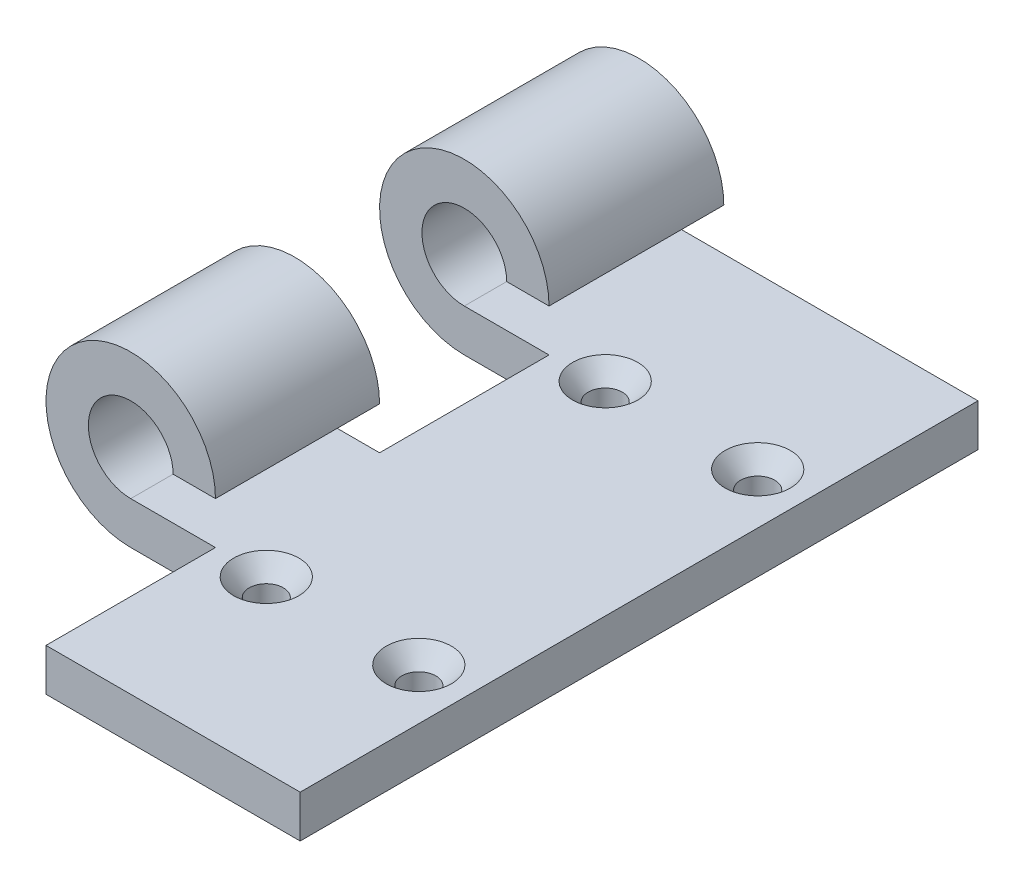
ISO-10303-21;
HEADER;
FILE_DESCRIPTION(('STEP AP214'),'2;1');
FILE_NAME('part.step','',(''),(''),'','','');
FILE_SCHEMA(('AUTOMOTIVE_DESIGN { 1 0 10303 214 1 1 1 1 }'));
ENDSEC;
DATA;
#1=APPLICATION_CONTEXT('core data for automotive mechanical design processes');
#2=APPLICATION_PROTOCOL_DEFINITION('international standard','automotive_design',2000,#1);
#3=PRODUCT_CONTEXT('',#1,'mechanical');
#4=PRODUCT('Part','Part','',(#3));
#5=PRODUCT_RELATED_PRODUCT_CATEGORY('part','',(#4));
#6=PRODUCT_DEFINITION_FORMATION('','',#4);
#7=PRODUCT_DEFINITION_CONTEXT('part definition',#1,'design');
#8=PRODUCT_DEFINITION('design','',#6,#7);
#9=PRODUCT_DEFINITION_SHAPE('','',#8);
#10=(LENGTH_UNIT() NAMED_UNIT(*) SI_UNIT(.MILLI.,.METRE.));
#11=(NAMED_UNIT(*) PLANE_ANGLE_UNIT() SI_UNIT($,.RADIAN.));
#12=(NAMED_UNIT(*) SI_UNIT($,.STERADIAN.) SOLID_ANGLE_UNIT());
#13=UNCERTAINTY_MEASURE_WITH_UNIT(LENGTH_MEASURE(1.E-05),#10,'distance_accuracy_value','');
#14=(GEOMETRIC_REPRESENTATION_CONTEXT(3) GLOBAL_UNCERTAINTY_ASSIGNED_CONTEXT((#13)) GLOBAL_UNIT_ASSIGNED_CONTEXT((#10,
#11,#12)) REPRESENTATION_CONTEXT('',''));
#15=CARTESIAN_POINT('',(0.,0.,0.));
#16=DIRECTION('',(0.,0.,1.));
#17=DIRECTION('',(1.,0.,0.));
#18=AXIS2_PLACEMENT_3D('',#15,#16,#17);
#19=CARTESIAN_POINT('',(-7.62000000000001,6.35,25.4));
#20=DIRECTION('',(0.,1.,0.));
#21=DIRECTION('',(0.,0.,1.));
#22=AXIS2_PLACEMENT_3D('',#19,#20,#21);
#23=CONICAL_SURFACE('',#22,4.8895,0.715584993317676);
#24=CARTESIAN_POINT('',(-7.62000000000001,3.66181910600595,25.4));
#25=DIRECTION('',(0.,1.,0.));
#26=DIRECTION('',(0.,0.,1.));
#27=AXIS2_PLACEMENT_3D('',#24,#25,#26);
#28=CIRCLE('',#27,2.5527);
#29=CARTESIAN_POINT('',(-7.62000000000001,3.66181910600595,27.9527));
#30=VERTEX_POINT('',#29);
#31=EDGE_CURVE('E11',#30,#30,#28,.T.);
#32=ORIENTED_EDGE('',*,*,#31,.F.);
#33=EDGE_LOOP('',(#32));
#34=FACE_BOUND('',#33,.T.);
#35=CARTESIAN_POINT('',(-7.62000000000001,6.35,25.4));
#36=DIRECTION('',(0.,1.,0.));
#37=DIRECTION('',(0.,0.,1.));
#38=AXIS2_PLACEMENT_3D('',#35,#36,#37);
#39=CIRCLE('',#38,4.8895);
#40=CARTESIAN_POINT('',(-7.62000000000001,6.35,30.2895));
#41=VERTEX_POINT('',#40);
#42=EDGE_CURVE('E261',#41,#41,#39,.T.);
#43=ORIENTED_EDGE('',*,*,#42,.T.);
#44=EDGE_LOOP('',(#43));
#45=FACE_BOUND('',#44,.T.);
#46=ADVANCED_FACE('F33',(#34,#45),#23,.F.);
#47=CARTESIAN_POINT('',(-7.62000000000001,6.35,25.4));
#48=DIRECTION('',(0.,1.,0.));
#49=DIRECTION('',(0.,0.,1.));
#50=AXIS2_PLACEMENT_3D('',#47,#48,#49);
#51=CYLINDRICAL_SURFACE('',#50,2.5527);
#52=CARTESIAN_POINT('',(-7.62000000000001,0.,25.4));
#53=DIRECTION('',(0.,1.,0.));
#54=DIRECTION('',(0.,0.,1.));
#55=AXIS2_PLACEMENT_3D('',#52,#53,#54);
#56=CIRCLE('',#55,2.5527);
#57=CARTESIAN_POINT('',(-7.62000000000001,0.,27.9527));
#58=VERTEX_POINT('',#57);
#59=EDGE_CURVE('E40',#58,#58,#56,.T.);
#60=ORIENTED_EDGE('',*,*,#59,.F.);
#61=EDGE_LOOP('',(#60));
#62=FACE_BOUND('',#61,.T.);
#63=ORIENTED_EDGE('',*,*,#31,.T.);
#64=EDGE_LOOP('',(#63));
#65=FACE_BOUND('',#64,.T.);
#66=ADVANCED_FACE('F267',(#62,#65),#51,.F.);
#67=CARTESIAN_POINT('',(-7.62000000000001,6.35,-25.4));
#68=DIRECTION('',(0.,1.,0.));
#69=DIRECTION('',(0.,0.,1.));
#70=AXIS2_PLACEMENT_3D('',#67,#68,#69);
#71=CONICAL_SURFACE('',#70,4.8895,0.715584993317676);
#72=CARTESIAN_POINT('',(-7.62000000000001,3.66181910600595,-25.4));
#73=DIRECTION('',(0.,1.,0.));
#74=DIRECTION('',(0.,0.,1.));
#75=AXIS2_PLACEMENT_3D('',#72,#73,#74);
#76=CIRCLE('',#75,2.5527);
#77=CARTESIAN_POINT('',(-7.62000000000001,3.66181910600595,-22.8473));
#78=VERTEX_POINT('',#77);
#79=EDGE_CURVE('E258',#78,#78,#76,.T.);
#80=ORIENTED_EDGE('',*,*,#79,.F.);
#81=EDGE_LOOP('',(#80));
#82=FACE_BOUND('',#81,.T.);
#83=CARTESIAN_POINT('',(-7.62000000000001,6.35,-25.4));
#84=DIRECTION('',(0.,1.,0.));
#85=DIRECTION('',(0.,0.,1.));
#86=AXIS2_PLACEMENT_3D('',#83,#84,#85);
#87=CIRCLE('',#86,4.8895);
#88=CARTESIAN_POINT('',(-7.62000000000001,6.35,-20.5105));
#89=VERTEX_POINT('',#88);
#90=EDGE_CURVE('E252',#89,#89,#87,.T.);
#91=ORIENTED_EDGE('',*,*,#90,.T.);
#92=EDGE_LOOP('',(#91));
#93=FACE_BOUND('',#92,.T.);
#94=ADVANCED_FACE('F270',(#82,#93),#71,.F.);
#95=CARTESIAN_POINT('',(-7.62000000000001,6.35,-25.4));
#96=DIRECTION('',(0.,1.,0.));
#97=DIRECTION('',(0.,0.,1.));
#98=AXIS2_PLACEMENT_3D('',#95,#96,#97);
#99=CYLINDRICAL_SURFACE('',#98,2.5527);
#100=CARTESIAN_POINT('',(-7.62000000000001,0.,-25.4));
#101=DIRECTION('',(0.,1.,0.));
#102=DIRECTION('',(0.,0.,1.));
#103=AXIS2_PLACEMENT_3D('',#100,#101,#102);
#104=CIRCLE('',#103,2.5527);
#105=CARTESIAN_POINT('',(-7.62000000000001,0.,-22.8473));
#106=VERTEX_POINT('',#105);
#107=EDGE_CURVE('E255',#106,#106,#104,.T.);
#108=ORIENTED_EDGE('',*,*,#107,.F.);
#109=EDGE_LOOP('',(#108));
#110=FACE_BOUND('',#109,.T.);
#111=ORIENTED_EDGE('',*,*,#79,.T.);
#112=EDGE_LOOP('',(#111));
#113=FACE_BOUND('',#112,.T.);
#114=ADVANCED_FACE('F314',(#110,#113),#99,.F.);
#115=CARTESIAN_POINT('',(-50.8,12.7,50.8));
#116=DIRECTION('',(0.,0.,-1.));
#117=DIRECTION('',(-1.,0.,0.));
#118=AXIS2_PLACEMENT_3D('',#115,#116,#117);
#119=CYLINDRICAL_SURFACE('',#118,6.34999999999999);
#120=DIRECTION('',(0.,0.,-1.));
#121=VECTOR('',#120,1.);
#122=CARTESIAN_POINT('',(-44.45,12.7,50.8));
#123=LINE('',#122,#121);
#124=CARTESIAN_POINT('',(-44.45,12.7,-24.6));
#125=VERTEX_POINT('',#124);
#126=CARTESIAN_POINT('',(-44.45,12.7,-50.8));
#127=VERTEX_POINT('',#126);
#128=EDGE_CURVE('E239',#125,#127,#123,.T.);
#129=ORIENTED_EDGE('',*,*,#128,.F.);
#130=CARTESIAN_POINT('',(-50.8,12.7,-24.6));
#131=DIRECTION('',(0.,0.,-1.));
#132=DIRECTION('',(-1.,0.,0.));
#133=AXIS2_PLACEMENT_3D('',#130,#131,#132);
#134=CIRCLE('',#133,6.34999999999999);
#135=CARTESIAN_POINT('',(-50.8,6.35,-24.6));
#136=VERTEX_POINT('',#135);
#137=EDGE_CURVE('E171',#125,#136,#134,.F.);
#138=ORIENTED_EDGE('',*,*,#137,.T.);
#139=DIRECTION('',(0.,0.,-1.));
#140=VECTOR('',#139,1.);
#141=CARTESIAN_POINT('',(-50.8,6.35,50.8));
#142=LINE('',#141,#140);
#143=CARTESIAN_POINT('',(-50.8,6.35,-50.8));
#144=VERTEX_POINT('',#143);
#145=EDGE_CURVE('E209',#136,#144,#142,.T.);
#146=ORIENTED_EDGE('',*,*,#145,.T.);
#147=CARTESIAN_POINT('',(-50.8,12.7,-50.8));
#148=DIRECTION('',(0.,0.,1.));
#149=DIRECTION('',(1.,0.,0.));
#150=AXIS2_PLACEMENT_3D('',#147,#148,#149);
#151=CIRCLE('',#150,6.34999999999999);
#152=EDGE_CURVE('E198',#144,#127,#151,.F.);
#153=ORIENTED_EDGE('',*,*,#152,.T.);
#154=EDGE_LOOP('',(#129,#138,#146,#153));
#155=FACE_BOUND('',#154,.T.);
#156=ADVANCED_FACE('F313',(#155),#119,.F.);
#157=CARTESIAN_POINT('',(-38.1,12.7,50.8));
#158=DIRECTION('',(0.,-1.,0.));
#159=DIRECTION('',(1.,0.,0.));
#160=AXIS2_PLACEMENT_3D('',#157,#158,#159);
#161=PLANE('',#160);
#162=DIRECTION('',(1.,0.,0.));
#163=VECTOR('',#162,1.);
#164=CARTESIAN_POINT('',(-38.1,12.7,-24.6));
#165=LINE('',#164,#163);
#166=CARTESIAN_POINT('',(-38.1,12.7,-24.6));
#167=VERTEX_POINT('',#166);
#168=EDGE_CURVE('E174',#125,#167,#165,.T.);
#169=ORIENTED_EDGE('',*,*,#168,.F.);
#170=ORIENTED_EDGE('',*,*,#128,.T.);
#171=DIRECTION('',(-1.,0.,0.));
#172=VECTOR('',#171,1.);
#173=CARTESIAN_POINT('',(-38.1,12.7,-50.8));
#174=LINE('',#173,#172);
#175=CARTESIAN_POINT('',(-38.1,12.7,-50.8));
#176=VERTEX_POINT('',#175);
#177=EDGE_CURVE('E212',#176,#127,#174,.T.);
#178=ORIENTED_EDGE('',*,*,#177,.F.);
#179=DIRECTION('',(0.,0.,-1.));
#180=VECTOR('',#179,1.);
#181=CARTESIAN_POINT('',(-38.1,12.7,50.8));
#182=LINE('',#181,#180);
#183=EDGE_CURVE('E235',#167,#176,#182,.T.);
#184=ORIENTED_EDGE('',*,*,#183,.F.);
#185=EDGE_LOOP('',(#169,#170,#178,#184));
#186=FACE_BOUND('',#185,.T.);
#187=ADVANCED_FACE('F309',(#186),#161,.T.);
#188=CARTESIAN_POINT('',(-50.8,12.7,50.8));
#189=DIRECTION('',(0.,0.,-1.));
#190=DIRECTION('',(-1.,0.,0.));
#191=AXIS2_PLACEMENT_3D('',#188,#189,#190);
#192=CYLINDRICAL_SURFACE('',#191,12.7);
#193=CARTESIAN_POINT('',(-50.8,12.7,0.799999999999995));
#194=DIRECTION('',(0.,0.,1.));
#195=DIRECTION('',(1.,0.,0.));
#196=AXIS2_PLACEMENT_3D('',#193,#194,#195);
#197=CIRCLE('',#196,12.7);
#198=CARTESIAN_POINT('',(-50.8,0.,0.799999999999995));
#199=VERTEX_POINT('',#198);
#200=CARTESIAN_POINT('',(-38.1,12.7,0.799999999999995));
#201=VERTEX_POINT('',#200);
#202=EDGE_CURVE('E169',#199,#201,#197,.F.);
#203=ORIENTED_EDGE('',*,*,#202,.F.);
#204=DIRECTION('',(0.,0.,-1.));
#205=VECTOR('',#204,1.);
#206=CARTESIAN_POINT('',(-50.8,0.,50.8));
#207=LINE('',#206,#205);
#208=CARTESIAN_POINT('',(-50.8,0.,25.4));
#209=VERTEX_POINT('',#208);
#210=EDGE_CURVE('E156',#209,#199,#207,.T.);
#211=ORIENTED_EDGE('',*,*,#210,.F.);
#212=CARTESIAN_POINT('',(-50.8,12.7,25.4));
#213=DIRECTION('',(0.,0.,-1.));
#214=DIRECTION('',(-1.,0.,0.));
#215=AXIS2_PLACEMENT_3D('',#212,#213,#214);
#216=CIRCLE('',#215,12.7);
#217=CARTESIAN_POINT('',(-38.1,12.7,25.4));
#218=VERTEX_POINT('',#217);
#219=EDGE_CURVE('E196',#218,#209,#216,.F.);
#220=ORIENTED_EDGE('',*,*,#219,.F.);
#221=EDGE_CURVE('E236',#218,#201,#182,.T.);
#222=ORIENTED_EDGE('',*,*,#221,.T.);
#223=EDGE_LOOP('',(#203,#211,#220,#222));
#224=FACE_BOUND('',#223,.T.);
#225=ADVANCED_FACE('F304',(#224),#192,.T.);
#226=CARTESIAN_POINT('',(-50.8,6.35,25.4));
#227=VERTEX_POINT('',#226);
#228=CARTESIAN_POINT('',(-50.8,6.35,0.799999999999995));
#229=VERTEX_POINT('',#228);
#230=EDGE_CURVE('E226',#227,#229,#142,.T.);
#231=ORIENTED_EDGE('',*,*,#230,.T.);
#232=CARTESIAN_POINT('',(-50.8,12.7,0.799999999999995));
#233=DIRECTION('',(0.,0.,1.));
#234=DIRECTION('',(1.,0.,0.));
#235=AXIS2_PLACEMENT_3D('',#232,#233,#234);
#236=CIRCLE('',#235,6.34999999999999);
#237=CARTESIAN_POINT('',(-44.45,12.7,0.799999999999995));
#238=VERTEX_POINT('',#237);
#239=EDGE_CURVE('E47',#229,#238,#236,.F.);
#240=ORIENTED_EDGE('',*,*,#239,.T.);
#241=CARTESIAN_POINT('',(-44.45,12.7,25.4));
#242=VERTEX_POINT('',#241);
#243=EDGE_CURVE('E240',#242,#238,#123,.T.);
#244=ORIENTED_EDGE('',*,*,#243,.F.);
#245=CARTESIAN_POINT('',(-50.8,12.7,25.4));
#246=DIRECTION('',(0.,0.,-1.));
#247=DIRECTION('',(-1.,0.,0.));
#248=AXIS2_PLACEMENT_3D('',#245,#246,#247);
#249=CIRCLE('',#248,6.34999999999999);
#250=EDGE_CURVE('E190',#242,#227,#249,.F.);
#251=ORIENTED_EDGE('',*,*,#250,.T.);
#252=EDGE_LOOP('',(#231,#240,#244,#251));
#253=FACE_BOUND('',#252,.T.);
#254=ADVANCED_FACE('F307',(#253),#119,.F.);
#255=DIRECTION('',(-1.,0.,0.));
#256=VECTOR('',#255,1.);
#257=CARTESIAN_POINT('',(-38.1,12.7,0.799999999999995));
#258=LINE('',#257,#256);
#259=EDGE_CURVE('E167',#201,#238,#258,.T.);
#260=ORIENTED_EDGE('',*,*,#259,.F.);
#261=ORIENTED_EDGE('',*,*,#221,.F.);
#262=DIRECTION('',(1.,0.,0.));
#263=VECTOR('',#262,1.);
#264=CARTESIAN_POINT('',(-38.1,12.7,25.4));
#265=LINE('',#264,#263);
#266=EDGE_CURVE('E193',#242,#218,#265,.T.);
#267=ORIENTED_EDGE('',*,*,#266,.F.);
#268=ORIENTED_EDGE('',*,*,#243,.T.);
#269=EDGE_LOOP('',(#260,#261,#267,#268));
#270=FACE_BOUND('',#269,.T.);
#271=ADVANCED_FACE('F302',(#270),#161,.T.);
#272=CARTESIAN_POINT('',(-50.8,12.7,-24.6));
#273=DIRECTION('',(0.,0.,-1.));
#274=DIRECTION('',(-1.,0.,0.));
#275=AXIS2_PLACEMENT_3D('',#272,#273,#274);
#276=CIRCLE('',#275,12.7);
#277=CARTESIAN_POINT('',(-50.8,0.,-24.6));
#278=VERTEX_POINT('',#277);
#279=EDGE_CURVE('E177',#167,#278,#276,.F.);
#280=ORIENTED_EDGE('',*,*,#279,.F.);
#281=ORIENTED_EDGE('',*,*,#183,.T.);
#282=CARTESIAN_POINT('',(-50.8,12.7,-50.8));
#283=DIRECTION('',(0.,0.,-1.));
#284=DIRECTION('',(-1.,0.,0.));
#285=AXIS2_PLACEMENT_3D('',#282,#283,#284);
#286=CIRCLE('',#285,12.7);
#287=CARTESIAN_POINT('',(-50.8,0.,-50.8));
#288=VERTEX_POINT('',#287);
#289=EDGE_CURVE('E215',#288,#176,#286,.T.);
#290=ORIENTED_EDGE('',*,*,#289,.F.);
#291=EDGE_CURVE('E233',#278,#288,#207,.T.);
#292=ORIENTED_EDGE('',*,*,#291,.F.);
#293=EDGE_LOOP('',(#280,#281,#290,#292));
#294=FACE_BOUND('',#293,.T.);
#295=ADVANCED_FACE('F298',(#294),#192,.T.);
#296=CARTESIAN_POINT('',(0.,0.,50.8));
#297=DIRECTION('',(0.,-1.,0.));
#298=DIRECTION('',(0.,0.,-1.));
#299=AXIS2_PLACEMENT_3D('',#296,#297,#298);
#300=PLANE('',#299);
#301=CARTESIAN_POINT('',(-30.48,0.,25.4));
#302=DIRECTION('',(0.,1.,0.));
#303=DIRECTION('',(0.,0.,1.));
#304=AXIS2_PLACEMENT_3D('',#301,#302,#303);
#305=CIRCLE('',#304,2.5527);
#306=CARTESIAN_POINT('',(-30.48,0.,27.9527));
#307=VERTEX_POINT('',#306);
#308=EDGE_CURVE('E501',#307,#307,#305,.T.);
#309=ORIENTED_EDGE('',*,*,#308,.T.);
#310=EDGE_LOOP('',(#309));
#311=FACE_BOUND('',#310,.T.);
#312=CARTESIAN_POINT('',(-30.48,0.,-25.4));
#313=DIRECTION('',(0.,1.,0.));
#314=DIRECTION('',(0.,0.,1.));
#315=AXIS2_PLACEMENT_3D('',#312,#313,#314);
#316=CIRCLE('',#315,2.5527);
#317=CARTESIAN_POINT('',(-30.48,0.,-22.8473));
#318=VERTEX_POINT('',#317);
#319=EDGE_CURVE('E157',#318,#318,#316,.T.);
#320=ORIENTED_EDGE('',*,*,#319,.T.);
#321=EDGE_LOOP('',(#320));
#322=FACE_BOUND('',#321,.T.);
#323=DIRECTION('',(-1.,0.,0.));
#324=VECTOR('',#323,1.);
#325=CARTESIAN_POINT('',(-63.5,0.,-24.6));
#326=LINE('',#325,#324);
#327=CARTESIAN_POINT('',(-38.1,0.,-24.6));
#328=VERTEX_POINT('',#327);
#329=EDGE_CURVE('E141',#328,#278,#326,.T.);
#330=ORIENTED_EDGE('',*,*,#329,.T.);
#331=ORIENTED_EDGE('',*,*,#291,.T.);
#332=DIRECTION('',(-1.,0.,0.));
#333=VECTOR('',#332,1.);
#334=CARTESIAN_POINT('',(0.,0.,-50.8));
#335=LINE('',#334,#333);
#336=CARTESIAN_POINT('',(0.,0.,-50.8));
#337=VERTEX_POINT('',#336);
#338=EDGE_CURVE('E218',#337,#288,#335,.T.);
#339=ORIENTED_EDGE('',*,*,#338,.F.);
#340=DIRECTION('',(0.,0.,-1.));
#341=VECTOR('',#340,1.);
#342=CARTESIAN_POINT('',(0.,0.,50.8));
#343=LINE('',#342,#341);
#344=CARTESIAN_POINT('',(0.,0.,50.8));
#345=VERTEX_POINT('',#344);
#346=EDGE_CURVE('E231',#345,#337,#343,.T.);
#347=ORIENTED_EDGE('',*,*,#346,.F.);
#348=DIRECTION('',(-1.,0.,0.));
#349=VECTOR('',#348,1.);
#350=CARTESIAN_POINT('',(0.,0.,50.8));
#351=LINE('',#350,#349);
#352=CARTESIAN_POINT('',(-38.1,0.,50.8));
#353=VERTEX_POINT('',#352);
#354=EDGE_CURVE('E199',#345,#353,#351,.T.);
#355=ORIENTED_EDGE('',*,*,#354,.T.);
#356=DIRECTION('',(0.,0.,-1.));
#357=VECTOR('',#356,1.);
#358=CARTESIAN_POINT('',(-38.1,0.,50.8));
#359=LINE('',#358,#357);
#360=CARTESIAN_POINT('',(-38.1,0.,25.4));
#361=VERTEX_POINT('',#360);
#362=EDGE_CURVE('E55',#353,#361,#359,.T.);
#363=ORIENTED_EDGE('',*,*,#362,.T.);
#364=DIRECTION('',(-1.,0.,0.));
#365=VECTOR('',#364,1.);
#366=CARTESIAN_POINT('',(-63.5,0.,25.4));
#367=LINE('',#366,#365);
#368=EDGE_CURVE('E180',#361,#209,#367,.T.);
#369=ORIENTED_EDGE('',*,*,#368,.T.);
#370=ORIENTED_EDGE('',*,*,#210,.T.);
#371=DIRECTION('',(1.,0.,0.));
#372=VECTOR('',#371,1.);
#373=CARTESIAN_POINT('',(-63.5,0.,0.799999999999995));
#374=LINE('',#373,#372);
#375=CARTESIAN_POINT('',(-38.1,0.,0.799999999999995));
#376=VERTEX_POINT('',#375);
#377=EDGE_CURVE('E135',#199,#376,#374,.T.);
#378=ORIENTED_EDGE('',*,*,#377,.T.);
#379=DIRECTION('',(0.,0.,-1.));
#380=VECTOR('',#379,1.);
#381=CARTESIAN_POINT('',(-38.1,0.,0.799999999999995));
#382=LINE('',#381,#380);
#383=EDGE_CURVE('E144',#376,#328,#382,.T.);
#384=ORIENTED_EDGE('',*,*,#383,.T.);
#385=EDGE_LOOP('',(#330,#331,#339,#347,#355,#363,#369,#370,#378,#384));
#386=FACE_BOUND('',#385,.T.);
#387=ORIENTED_EDGE('',*,*,#107,.T.);
#388=EDGE_LOOP('',(#387));
#389=FACE_BOUND('',#388,.T.);
#390=ORIENTED_EDGE('',*,*,#59,.T.);
#391=EDGE_LOOP('',(#390));
#392=FACE_BOUND('',#391,.T.);
#393=ADVANCED_FACE('F152',(#311,#322,#386,#389,#392),#300,.T.);
#394=CARTESIAN_POINT('',(0.,6.35,50.8));
#395=DIRECTION('',(1.,0.,0.));
#396=DIRECTION('',(0.,0.,-1.));
#397=AXIS2_PLACEMENT_3D('',#394,#395,#396);
#398=PLANE('',#397);
#399=DIRECTION('',(0.,-1.,0.));
#400=VECTOR('',#399,1.);
#401=CARTESIAN_POINT('',(0.,6.35,-50.8));
#402=LINE('',#401,#400);
#403=CARTESIAN_POINT('',(0.,6.35,-50.8));
#404=VERTEX_POINT('',#403);
#405=EDGE_CURVE('E221',#404,#337,#402,.T.);
#406=ORIENTED_EDGE('',*,*,#405,.F.);
#407=DIRECTION('',(0.,0.,-1.));
#408=VECTOR('',#407,1.);
#409=CARTESIAN_POINT('',(0.,6.35,50.8));
#410=LINE('',#409,#408);
#411=CARTESIAN_POINT('',(0.,6.35,50.8));
#412=VERTEX_POINT('',#411);
#413=EDGE_CURVE('E229',#412,#404,#410,.T.);
#414=ORIENTED_EDGE('',*,*,#413,.F.);
#415=DIRECTION('',(0.,-1.,0.));
#416=VECTOR('',#415,1.);
#417=CARTESIAN_POINT('',(0.,6.35,50.8));
#418=LINE('',#417,#416);
#419=EDGE_CURVE('E202',#412,#345,#418,.T.);
#420=ORIENTED_EDGE('',*,*,#419,.T.);
#421=ORIENTED_EDGE('',*,*,#346,.T.);
#422=EDGE_LOOP('',(#406,#414,#420,#421));
#423=FACE_BOUND('',#422,.T.);
#424=ADVANCED_FACE('F280',(#423),#398,.T.);
#425=CARTESIAN_POINT('',(0.,6.35,50.8));
#426=DIRECTION('',(0.,-1.,0.));
#427=DIRECTION('',(0.,0.,-1.));
#428=AXIS2_PLACEMENT_3D('',#425,#426,#427);
#429=PLANE('',#428);
#430=CARTESIAN_POINT('',(-30.48,6.35,25.4));
#431=DIRECTION('',(0.,1.,0.));
#432=DIRECTION('',(0.,0.,1.));
#433=AXIS2_PLACEMENT_3D('',#430,#431,#432);
#434=CIRCLE('',#433,4.8895);
#435=CARTESIAN_POINT('',(-30.48,6.35,30.2895));
#436=VERTEX_POINT('',#435);
#437=EDGE_CURVE('E500',#436,#436,#434,.T.);
#438=ORIENTED_EDGE('',*,*,#437,.F.);
#439=EDGE_LOOP('',(#438));
#440=FACE_BOUND('',#439,.T.);
#441=CARTESIAN_POINT('',(-30.48,6.35,-25.4));
#442=DIRECTION('',(0.,1.,0.));
#443=DIRECTION('',(0.,0.,1.));
#444=AXIS2_PLACEMENT_3D('',#441,#442,#443);
#445=CIRCLE('',#444,4.8895);
#446=CARTESIAN_POINT('',(-30.48,6.35,-20.5105));
#447=VERTEX_POINT('',#446);
#448=EDGE_CURVE('E507',#447,#447,#445,.T.);
#449=ORIENTED_EDGE('',*,*,#448,.F.);
#450=EDGE_LOOP('',(#449));
#451=FACE_BOUND('',#450,.T.);
#452=ORIENTED_EDGE('',*,*,#145,.F.);
#453=DIRECTION('',(1.,0.,0.));
#454=VECTOR('',#453,1.);
#455=CARTESIAN_POINT('',(0.,6.35,-24.6));
#456=LINE('',#455,#454);
#457=CARTESIAN_POINT('',(-38.1,6.35,-24.6));
#458=VERTEX_POINT('',#457);
#459=EDGE_CURVE('E249',#136,#458,#456,.T.);
#460=ORIENTED_EDGE('',*,*,#459,.T.);
#461=DIRECTION('',(0.,0.,1.));
#462=VECTOR('',#461,1.);
#463=CARTESIAN_POINT('',(-38.1,6.35,50.8));
#464=LINE('',#463,#462);
#465=CARTESIAN_POINT('',(-38.1,6.35,0.799999999999995));
#466=VERTEX_POINT('',#465);
#467=EDGE_CURVE('E247',#458,#466,#464,.T.);
#468=ORIENTED_EDGE('',*,*,#467,.T.);
#469=DIRECTION('',(-1.,0.,0.));
#470=VECTOR('',#469,1.);
#471=CARTESIAN_POINT('',(0.,6.35,0.799999999999995));
#472=LINE('',#471,#470);
#473=EDGE_CURVE('E137',#466,#229,#472,.T.);
#474=ORIENTED_EDGE('',*,*,#473,.T.);
#475=ORIENTED_EDGE('',*,*,#230,.F.);
#476=DIRECTION('',(1.,0.,0.));
#477=VECTOR('',#476,1.);
#478=CARTESIAN_POINT('',(0.,6.35,25.4));
#479=LINE('',#478,#477);
#480=CARTESIAN_POINT('',(-38.1,6.35,25.4));
#481=VERTEX_POINT('',#480);
#482=EDGE_CURVE('E243',#227,#481,#479,.T.);
#483=ORIENTED_EDGE('',*,*,#482,.T.);
#484=DIRECTION('',(0.,0.,1.));
#485=VECTOR('',#484,1.);
#486=CARTESIAN_POINT('',(-38.1,6.35,50.8));
#487=LINE('',#486,#485);
#488=CARTESIAN_POINT('',(-38.1,6.35,50.8));
#489=VERTEX_POINT('',#488);
#490=EDGE_CURVE('E186',#481,#489,#487,.T.);
#491=ORIENTED_EDGE('',*,*,#490,.T.);
#492=DIRECTION('',(1.,0.,0.));
#493=VECTOR('',#492,1.);
#494=CARTESIAN_POINT('',(0.,6.35,50.8));
#495=LINE('',#494,#493);
#496=EDGE_CURVE('E206',#412,#489,#495,.F.);
#497=ORIENTED_EDGE('',*,*,#496,.F.);
#498=ORIENTED_EDGE('',*,*,#413,.T.);
#499=DIRECTION('',(1.,0.,0.));
#500=VECTOR('',#499,1.);
#501=CARTESIAN_POINT('',(0.,6.35,-50.8));
#502=LINE('',#501,#500);
#503=EDGE_CURVE('E203',#404,#144,#502,.F.);
#504=ORIENTED_EDGE('',*,*,#503,.T.);
#505=EDGE_LOOP('',(#452,#460,#468,#474,#475,#483,#491,#497,#498,#504));
#506=FACE_BOUND('',#505,.T.);
#507=ORIENTED_EDGE('',*,*,#90,.F.);
#508=EDGE_LOOP('',(#507));
#509=FACE_BOUND('',#508,.T.);
#510=ORIENTED_EDGE('',*,*,#42,.F.);
#511=EDGE_LOOP('',(#510));
#512=FACE_BOUND('',#511,.T.);
#513=ADVANCED_FACE('F277',(#440,#451,#506,#509,#512),#429,.F.);
#514=CARTESIAN_POINT('',(-50.8,12.7,50.8));
#515=DIRECTION('',(0.,0.,1.));
#516=DIRECTION('',(1.,0.,0.));
#517=AXIS2_PLACEMENT_3D('',#514,#515,#516);
#518=PLANE('',#517);
#519=DIRECTION('',(0.,1.,0.));
#520=VECTOR('',#519,1.);
#521=CARTESIAN_POINT('',(-38.1,0.,50.8));
#522=LINE('',#521,#520);
#523=EDGE_CURVE('E182',#353,#489,#522,.T.);
#524=ORIENTED_EDGE('',*,*,#523,.F.);
#525=ORIENTED_EDGE('',*,*,#354,.F.);
#526=ORIENTED_EDGE('',*,*,#419,.F.);
#527=ORIENTED_EDGE('',*,*,#496,.T.);
#528=EDGE_LOOP('',(#524,#525,#526,#527));
#529=FACE_BOUND('',#528,.T.);
#530=ADVANCED_FACE('F279',(#529),#518,.T.);
#531=CARTESIAN_POINT('',(-50.8,12.7,-50.8));
#532=DIRECTION('',(0.,0.,1.));
#533=DIRECTION('',(1.,0.,0.));
#534=AXIS2_PLACEMENT_3D('',#531,#532,#533);
#535=PLANE('',#534);
#536=ORIENTED_EDGE('',*,*,#152,.F.);
#537=ORIENTED_EDGE('',*,*,#503,.F.);
#538=ORIENTED_EDGE('',*,*,#405,.T.);
#539=ORIENTED_EDGE('',*,*,#338,.T.);
#540=ORIENTED_EDGE('',*,*,#289,.T.);
#541=ORIENTED_EDGE('',*,*,#177,.T.);
#542=EDGE_LOOP('',(#536,#537,#538,#539,#540,#541));
#543=FACE_BOUND('',#542,.T.);
#544=ADVANCED_FACE('F287',(#543),#535,.F.);
#545=CARTESIAN_POINT('',(-38.1,0.,50.8));
#546=DIRECTION('',(1.,0.,0.));
#547=DIRECTION('',(0.,0.,-1.));
#548=AXIS2_PLACEMENT_3D('',#545,#546,#547);
#549=PLANE('',#548);
#550=DIRECTION('',(0.,1.,0.));
#551=VECTOR('',#550,1.);
#552=CARTESIAN_POINT('',(-38.1,0.,25.4));
#553=LINE('',#552,#551);
#554=EDGE_CURVE('E183',#361,#481,#553,.T.);
#555=ORIENTED_EDGE('',*,*,#554,.F.);
#556=ORIENTED_EDGE('',*,*,#362,.F.);
#557=ORIENTED_EDGE('',*,*,#523,.T.);
#558=ORIENTED_EDGE('',*,*,#490,.F.);
#559=EDGE_LOOP('',(#555,#556,#557,#558));
#560=FACE_BOUND('',#559,.T.);
#561=ADVANCED_FACE('F383',(#560),#549,.F.);
#562=CARTESIAN_POINT('',(-63.5,0.,25.4));
#563=DIRECTION('',(0.,0.,-1.));
#564=DIRECTION('',(-1.,0.,0.));
#565=AXIS2_PLACEMENT_3D('',#562,#563,#564);
#566=PLANE('',#565);
#567=ORIENTED_EDGE('',*,*,#219,.T.);
#568=ORIENTED_EDGE('',*,*,#368,.F.);
#569=ORIENTED_EDGE('',*,*,#554,.T.);
#570=ORIENTED_EDGE('',*,*,#482,.F.);
#571=ORIENTED_EDGE('',*,*,#250,.F.);
#572=ORIENTED_EDGE('',*,*,#266,.T.);
#573=EDGE_LOOP('',(#567,#568,#569,#570,#571,#572));
#574=FACE_BOUND('',#573,.T.);
#575=ADVANCED_FACE('F397',(#574),#566,.F.);
#576=CARTESIAN_POINT('',(-38.1,0.,0.799999999999995));
#577=DIRECTION('',(1.,0.,0.));
#578=DIRECTION('',(0.,0.,-1.));
#579=AXIS2_PLACEMENT_3D('',#576,#577,#578);
#580=PLANE('',#579);
#581=DIRECTION('',(0.,1.,0.));
#582=VECTOR('',#581,1.);
#583=CARTESIAN_POINT('',(-38.1,0.,-24.6));
#584=LINE('',#583,#582);
#585=EDGE_CURVE('E140',#328,#458,#584,.T.);
#586=ORIENTED_EDGE('',*,*,#585,.F.);
#587=ORIENTED_EDGE('',*,*,#383,.F.);
#588=DIRECTION('',(0.,1.,0.));
#589=VECTOR('',#588,1.);
#590=CARTESIAN_POINT('',(-38.1,0.,0.799999999999995));
#591=LINE('',#590,#589);
#592=EDGE_CURVE('E131',#376,#466,#591,.T.);
#593=ORIENTED_EDGE('',*,*,#592,.T.);
#594=ORIENTED_EDGE('',*,*,#467,.F.);
#595=EDGE_LOOP('',(#586,#587,#593,#594));
#596=FACE_BOUND('',#595,.T.);
#597=ADVANCED_FACE('F145',(#596),#580,.F.);
#598=CARTESIAN_POINT('',(-63.5,0.,-24.6));
#599=DIRECTION('',(0.,0.,-1.));
#600=DIRECTION('',(-1.,0.,0.));
#601=AXIS2_PLACEMENT_3D('',#598,#599,#600);
#602=PLANE('',#601);
#603=ORIENTED_EDGE('',*,*,#279,.T.);
#604=ORIENTED_EDGE('',*,*,#329,.F.);
#605=ORIENTED_EDGE('',*,*,#585,.T.);
#606=ORIENTED_EDGE('',*,*,#459,.F.);
#607=ORIENTED_EDGE('',*,*,#137,.F.);
#608=ORIENTED_EDGE('',*,*,#168,.T.);
#609=EDGE_LOOP('',(#603,#604,#605,#606,#607,#608));
#610=FACE_BOUND('',#609,.T.);
#611=ADVANCED_FACE('F413',(#610),#602,.F.);
#612=CARTESIAN_POINT('',(-63.5,0.,0.799999999999995));
#613=DIRECTION('',(0.,0.,1.));
#614=DIRECTION('',(1.,0.,0.));
#615=AXIS2_PLACEMENT_3D('',#612,#613,#614);
#616=PLANE('',#615);
#617=ORIENTED_EDGE('',*,*,#202,.T.);
#618=ORIENTED_EDGE('',*,*,#259,.T.);
#619=ORIENTED_EDGE('',*,*,#239,.F.);
#620=ORIENTED_EDGE('',*,*,#473,.F.);
#621=ORIENTED_EDGE('',*,*,#592,.F.);
#622=ORIENTED_EDGE('',*,*,#377,.F.);
#623=EDGE_LOOP('',(#617,#618,#619,#620,#621,#622));
#624=FACE_BOUND('',#623,.T.);
#625=ADVANCED_FACE('F133',(#624),#616,.F.);
#626=CARTESIAN_POINT('',(-30.48,6.35,-25.4));
#627=DIRECTION('',(0.,1.,0.));
#628=DIRECTION('',(0.,0.,1.));
#629=AXIS2_PLACEMENT_3D('',#626,#627,#628);
#630=CYLINDRICAL_SURFACE('',#629,2.5527);
#631=ORIENTED_EDGE('',*,*,#319,.F.);
#632=EDGE_LOOP('',(#631));
#633=FACE_BOUND('',#632,.T.);
#634=CARTESIAN_POINT('',(-30.48,3.66181910600595,-25.4));
#635=DIRECTION('',(0.,1.,0.));
#636=DIRECTION('',(0.,0.,1.));
#637=AXIS2_PLACEMENT_3D('',#634,#635,#636);
#638=CIRCLE('',#637,2.5527);
#639=CARTESIAN_POINT('',(-30.48,3.66181910600595,-22.8473));
#640=VERTEX_POINT('',#639);
#641=EDGE_CURVE('E160',#640,#640,#638,.T.);
#642=ORIENTED_EDGE('',*,*,#641,.T.);
#643=EDGE_LOOP('',(#642));
#644=FACE_BOUND('',#643,.T.);
#645=ADVANCED_FACE('F427',(#633,#644),#630,.F.);
#646=CARTESIAN_POINT('',(-30.48,6.35,-25.4));
#647=DIRECTION('',(0.,1.,0.));
#648=DIRECTION('',(0.,0.,1.));
#649=AXIS2_PLACEMENT_3D('',#646,#647,#648);
#650=CONICAL_SURFACE('',#649,4.8895,0.715584993317676);
#651=ORIENTED_EDGE('',*,*,#641,.F.);
#652=EDGE_LOOP('',(#651));
#653=FACE_BOUND('',#652,.T.);
#654=ORIENTED_EDGE('',*,*,#448,.T.);
#655=EDGE_LOOP('',(#654));
#656=FACE_BOUND('',#655,.T.);
#657=ADVANCED_FACE('F434',(#653,#656),#650,.F.);
#658=CARTESIAN_POINT('',(-30.48,6.35,25.4));
#659=DIRECTION('',(0.,1.,0.));
#660=DIRECTION('',(0.,0.,1.));
#661=AXIS2_PLACEMENT_3D('',#658,#659,#660);
#662=CYLINDRICAL_SURFACE('',#661,2.5527);
#663=ORIENTED_EDGE('',*,*,#308,.F.);
#664=EDGE_LOOP('',(#663));
#665=FACE_BOUND('',#664,.T.);
#666=CARTESIAN_POINT('',(-30.48,3.66181910600595,25.4));
#667=DIRECTION('',(0.,1.,0.));
#668=DIRECTION('',(0.,0.,1.));
#669=AXIS2_PLACEMENT_3D('',#666,#667,#668);
#670=CIRCLE('',#669,2.5527);
#671=CARTESIAN_POINT('',(-30.48,3.66181910600595,27.9527));
#672=VERTEX_POINT('',#671);
#673=EDGE_CURVE('E498',#672,#672,#670,.T.);
#674=ORIENTED_EDGE('',*,*,#673,.T.);
#675=EDGE_LOOP('',(#674));
#676=FACE_BOUND('',#675,.T.);
#677=ADVANCED_FACE('F442',(#665,#676),#662,.F.);
#678=CARTESIAN_POINT('',(-30.48,6.35,25.4));
#679=DIRECTION('',(0.,1.,0.));
#680=DIRECTION('',(0.,0.,1.));
#681=AXIS2_PLACEMENT_3D('',#678,#679,#680);
#682=CONICAL_SURFACE('',#681,4.8895,0.715584993317676);
#683=ORIENTED_EDGE('',*,*,#673,.F.);
#684=EDGE_LOOP('',(#683));
#685=FACE_BOUND('',#684,.T.);
#686=ORIENTED_EDGE('',*,*,#437,.T.);
#687=EDGE_LOOP('',(#686));
#688=FACE_BOUND('',#687,.T.);
#689=ADVANCED_FACE('F451',(#685,#688),#682,.F.);
#690=CLOSED_SHELL('',(#46,#66,#94,#114,#156,#187,#225,#254,#271,#295,#393,#424,#513,#530,#544,
#561,#575,#597,#611,#625,#645,#657,#677,#689));
#691=MANIFOLD_SOLID_BREP('B2',#690);
#692=ADVANCED_BREP_SHAPE_REPRESENTATION('',(#18,#691),#14);
#693=SHAPE_DEFINITION_REPRESENTATION(#9,#692);
ENDSEC;
END-ISO-10303-21;
